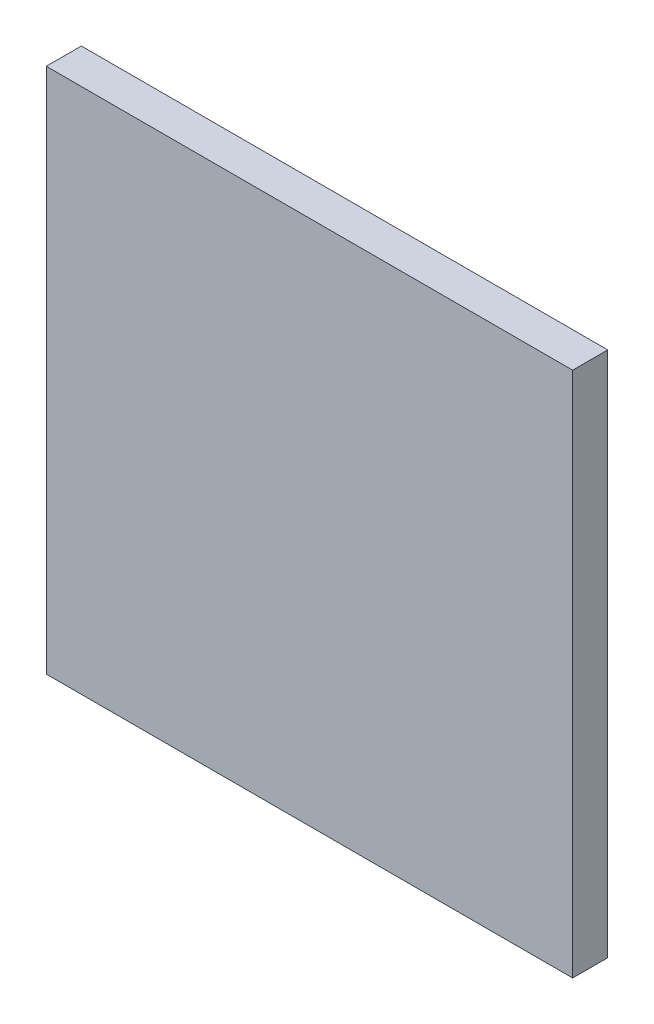
ISO-10303-21;
HEADER;
FILE_DESCRIPTION(('STEP AP214'),'2;1');
FILE_NAME('part.step','',(''),(''),'','','');
FILE_SCHEMA(('AUTOMOTIVE_DESIGN { 1 0 10303 214 1 1 1 1 }'));
ENDSEC;
DATA;
#1=APPLICATION_CONTEXT('core data for automotive mechanical design processes');
#2=APPLICATION_PROTOCOL_DEFINITION('international standard','automotive_design',2000,#1);
#3=PRODUCT_CONTEXT('',#1,'mechanical');
#4=PRODUCT('Part','Part','',(#3));
#5=PRODUCT_RELATED_PRODUCT_CATEGORY('part','',(#4));
#6=PRODUCT_DEFINITION_FORMATION('','',#4);
#7=PRODUCT_DEFINITION_CONTEXT('part definition',#1,'design');
#8=PRODUCT_DEFINITION('design','',#6,#7);
#9=PRODUCT_DEFINITION_SHAPE('','',#8);
#10=(LENGTH_UNIT() NAMED_UNIT(*) SI_UNIT(.MILLI.,.METRE.));
#11=(NAMED_UNIT(*) PLANE_ANGLE_UNIT() SI_UNIT($,.RADIAN.));
#12=(NAMED_UNIT(*) SI_UNIT($,.STERADIAN.) SOLID_ANGLE_UNIT());
#13=UNCERTAINTY_MEASURE_WITH_UNIT(LENGTH_MEASURE(1.E-05),#10,'distance_accuracy_value','');
#14=(GEOMETRIC_REPRESENTATION_CONTEXT(3) GLOBAL_UNCERTAINTY_ASSIGNED_CONTEXT((#13)) GLOBAL_UNIT_ASSIGNED_CONTEXT((#10,
#11,#12)) REPRESENTATION_CONTEXT('',''));
#15=CARTESIAN_POINT('',(0.,0.,0.));
#16=DIRECTION('',(0.,0.,1.));
#17=DIRECTION('',(1.,0.,0.));
#18=AXIS2_PLACEMENT_3D('',#15,#16,#17);
#19=CARTESIAN_POINT('',(15.,-15.,2.));
#20=DIRECTION('',(-1.,0.,0.));
#21=DIRECTION('',(0.,0.,1.));
#22=AXIS2_PLACEMENT_3D('',#19,#20,#21);
#23=PLANE('',#22);
#24=DIRECTION('',(0.,1.,0.));
#25=VECTOR('',#24,1.);
#26=CARTESIAN_POINT('',(15.,-15.,0.));
#27=LINE('',#26,#25);
#28=CARTESIAN_POINT('',(15.,-15.,0.));
#29=VERTEX_POINT('',#28);
#30=CARTESIAN_POINT('',(15.,15.,0.));
#31=VERTEX_POINT('',#30);
#32=EDGE_CURVE('E99',#29,#31,#27,.T.);
#33=ORIENTED_EDGE('',*,*,#32,.T.);
#34=DIRECTION('',(0.,0.,-1.));
#35=VECTOR('',#34,1.);
#36=CARTESIAN_POINT('',(15.,15.,2.));
#37=LINE('',#36,#35);
#38=CARTESIAN_POINT('',(15.,15.,2.));
#39=VERTEX_POINT('',#38);
#40=EDGE_CURVE('E11',#39,#31,#37,.T.);
#41=ORIENTED_EDGE('',*,*,#40,.F.);
#42=DIRECTION('',(0.,1.,0.));
#43=VECTOR('',#42,1.);
#44=CARTESIAN_POINT('',(15.,-15.,2.));
#45=LINE('',#44,#43);
#46=CARTESIAN_POINT('',(15.,-15.,2.));
#47=VERTEX_POINT('',#46);
#48=EDGE_CURVE('E87',#47,#39,#45,.T.);
#49=ORIENTED_EDGE('',*,*,#48,.F.);
#50=DIRECTION('',(0.,0.,-1.));
#51=VECTOR('',#50,1.);
#52=CARTESIAN_POINT('',(15.,-15.,2.));
#53=LINE('',#52,#51);
#54=EDGE_CURVE('E95',#47,#29,#53,.T.);
#55=ORIENTED_EDGE('',*,*,#54,.T.);
#56=EDGE_LOOP('',(#33,#41,#49,#55));
#57=FACE_BOUND('',#56,.T.);
#58=ADVANCED_FACE('F36',(#57),#23,.F.);
#59=CARTESIAN_POINT('',(-15.,15.,2.));
#60=DIRECTION('',(0.,-1.,0.));
#61=DIRECTION('',(0.,0.,-1.));
#62=AXIS2_PLACEMENT_3D('',#59,#60,#61);
#63=PLANE('',#62);
#64=DIRECTION('',(-1.,0.,0.));
#65=VECTOR('',#64,1.);
#66=CARTESIAN_POINT('',(-15.,15.,0.));
#67=LINE('',#66,#65);
#68=CARTESIAN_POINT('',(-15.,15.,0.));
#69=VERTEX_POINT('',#68);
#70=EDGE_CURVE('E91',#31,#69,#67,.T.);
#71=ORIENTED_EDGE('',*,*,#70,.T.);
#72=DIRECTION('',(0.,0.,-1.));
#73=VECTOR('',#72,1.);
#74=CARTESIAN_POINT('',(-15.,15.,2.));
#75=LINE('',#74,#73);
#76=CARTESIAN_POINT('',(-15.,15.,2.));
#77=VERTEX_POINT('',#76);
#78=EDGE_CURVE('E44',#77,#69,#75,.T.);
#79=ORIENTED_EDGE('',*,*,#78,.F.);
#80=DIRECTION('',(-1.,0.,0.));
#81=VECTOR('',#80,1.);
#82=CARTESIAN_POINT('',(-15.,15.,2.));
#83=LINE('',#82,#81);
#84=EDGE_CURVE('E82',#39,#77,#83,.T.);
#85=ORIENTED_EDGE('',*,*,#84,.F.);
#86=ORIENTED_EDGE('',*,*,#40,.T.);
#87=EDGE_LOOP('',(#71,#79,#85,#86));
#88=FACE_BOUND('',#87,.T.);
#89=ADVANCED_FACE('F90',(#88),#63,.F.);
#90=CARTESIAN_POINT('',(-15.,-15.,2.));
#91=DIRECTION('',(1.,0.,0.));
#92=DIRECTION('',(0.,0.,-1.));
#93=AXIS2_PLACEMENT_3D('',#90,#91,#92);
#94=PLANE('',#93);
#95=DIRECTION('',(0.,-1.,0.));
#96=VECTOR('',#95,1.);
#97=CARTESIAN_POINT('',(-15.,-15.,0.));
#98=LINE('',#97,#96);
#99=CARTESIAN_POINT('',(-15.,-15.,0.));
#100=VERTEX_POINT('',#99);
#101=EDGE_CURVE('E69',#69,#100,#98,.T.);
#102=ORIENTED_EDGE('',*,*,#101,.T.);
#103=DIRECTION('',(0.,0.,-1.));
#104=VECTOR('',#103,1.);
#105=CARTESIAN_POINT('',(-15.,-15.,2.));
#106=LINE('',#105,#104);
#107=CARTESIAN_POINT('',(-15.,-15.,2.));
#108=VERTEX_POINT('',#107);
#109=EDGE_CURVE('E92',#108,#100,#106,.T.);
#110=ORIENTED_EDGE('',*,*,#109,.F.);
#111=DIRECTION('',(0.,-1.,0.));
#112=VECTOR('',#111,1.);
#113=CARTESIAN_POINT('',(-15.,-15.,2.));
#114=LINE('',#113,#112);
#115=EDGE_CURVE('E85',#77,#108,#114,.T.);
#116=ORIENTED_EDGE('',*,*,#115,.F.);
#117=ORIENTED_EDGE('',*,*,#78,.T.);
#118=EDGE_LOOP('',(#102,#110,#116,#117));
#119=FACE_BOUND('',#118,.T.);
#120=ADVANCED_FACE('F93',(#119),#94,.F.);
#121=CARTESIAN_POINT('',(-15.,-15.,2.));
#122=DIRECTION('',(0.,1.,0.));
#123=DIRECTION('',(0.,0.,1.));
#124=AXIS2_PLACEMENT_3D('',#121,#122,#123);
#125=PLANE('',#124);
#126=DIRECTION('',(1.,0.,0.));
#127=VECTOR('',#126,1.);
#128=CARTESIAN_POINT('',(-15.,-15.,0.));
#129=LINE('',#128,#127);
#130=EDGE_CURVE('E75',#100,#29,#129,.T.);
#131=ORIENTED_EDGE('',*,*,#130,.T.);
#132=ORIENTED_EDGE('',*,*,#54,.F.);
#133=DIRECTION('',(1.,0.,0.));
#134=VECTOR('',#133,1.);
#135=CARTESIAN_POINT('',(-15.,-15.,2.));
#136=LINE('',#135,#134);
#137=EDGE_CURVE('E52',#108,#47,#136,.T.);
#138=ORIENTED_EDGE('',*,*,#137,.F.);
#139=ORIENTED_EDGE('',*,*,#109,.T.);
#140=EDGE_LOOP('',(#131,#132,#138,#139));
#141=FACE_BOUND('',#140,.T.);
#142=ADVANCED_FACE('F106',(#141),#125,.F.);
#143=CARTESIAN_POINT('',(0.,0.,2.));
#144=DIRECTION('',(0.,0.,-1.));
#145=DIRECTION('',(-1.,0.,0.));
#146=AXIS2_PLACEMENT_3D('',#143,#144,#145);
#147=PLANE('',#146);
#148=ORIENTED_EDGE('',*,*,#48,.T.);
#149=ORIENTED_EDGE('',*,*,#84,.T.);
#150=ORIENTED_EDGE('',*,*,#115,.T.);
#151=ORIENTED_EDGE('',*,*,#137,.T.);
#152=EDGE_LOOP('',(#148,#149,#150,#151));
#153=FACE_BOUND('',#152,.T.);
#154=ADVANCED_FACE('F83',(#153),#147,.F.);
#155=CARTESIAN_POINT('',(0.,0.,0.));
#156=DIRECTION('',(0.,0.,-1.));
#157=DIRECTION('',(-1.,0.,0.));
#158=AXIS2_PLACEMENT_3D('',#155,#156,#157);
#159=PLANE('',#158);
#160=ORIENTED_EDGE('',*,*,#32,.F.);
#161=ORIENTED_EDGE('',*,*,#130,.F.);
#162=ORIENTED_EDGE('',*,*,#101,.F.);
#163=ORIENTED_EDGE('',*,*,#70,.F.);
#164=EDGE_LOOP('',(#160,#161,#162,#163));
#165=FACE_BOUND('',#164,.T.);
#166=ADVANCED_FACE('F109',(#165),#159,.T.);
#167=CLOSED_SHELL('',(#58,#89,#120,#142,#154,#166));
#168=MANIFOLD_SOLID_BREP('B2',#167);
#169=ADVANCED_BREP_SHAPE_REPRESENTATION('',(#18,#168),#14);
#170=SHAPE_DEFINITION_REPRESENTATION(#9,#169);
ENDSEC;
END-ISO-10303-21;
